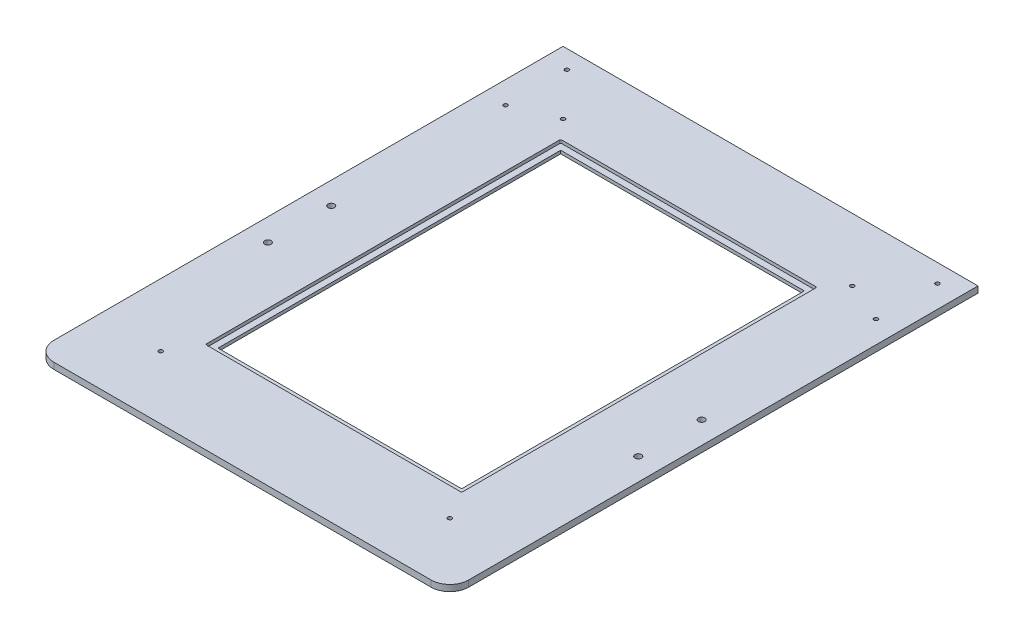
ISO-10303-21;
HEADER;
FILE_DESCRIPTION(('STEP AP214'),'2;1');
FILE_NAME('part.step','',(''),(''),'','','');
FILE_SCHEMA(('AUTOMOTIVE_DESIGN { 1 0 10303 214 1 1 1 1 }'));
ENDSEC;
DATA;
#1=APPLICATION_CONTEXT('core data for automotive mechanical design processes');
#2=APPLICATION_PROTOCOL_DEFINITION('international standard','automotive_design',2000,#1);
#3=PRODUCT_CONTEXT('',#1,'mechanical');
#4=PRODUCT('Part','Part','',(#3));
#5=PRODUCT_RELATED_PRODUCT_CATEGORY('part','',(#4));
#6=PRODUCT_DEFINITION_FORMATION('','',#4);
#7=PRODUCT_DEFINITION_CONTEXT('part definition',#1,'design');
#8=PRODUCT_DEFINITION('design','',#6,#7);
#9=PRODUCT_DEFINITION_SHAPE('','',#8);
#10=(LENGTH_UNIT() NAMED_UNIT(*) SI_UNIT(.MILLI.,.METRE.));
#11=(NAMED_UNIT(*) PLANE_ANGLE_UNIT() SI_UNIT($,.RADIAN.));
#12=(NAMED_UNIT(*) SI_UNIT($,.STERADIAN.) SOLID_ANGLE_UNIT());
#13=UNCERTAINTY_MEASURE_WITH_UNIT(LENGTH_MEASURE(1.E-05),#10,'distance_accuracy_value','');
#14=(GEOMETRIC_REPRESENTATION_CONTEXT(3) GLOBAL_UNCERTAINTY_ASSIGNED_CONTEXT((#13)) GLOBAL_UNIT_ASSIGNED_CONTEXT((#10,
#11,#12)) REPRESENTATION_CONTEXT('',''));
#15=CARTESIAN_POINT('',(0.,0.,0.));
#16=DIRECTION('',(0.,0.,1.));
#17=DIRECTION('',(1.,0.,0.));
#18=AXIS2_PLACEMENT_3D('',#15,#16,#17);
#19=CARTESIAN_POINT('',(0.,6.35,0.));
#20=DIRECTION('',(0.,-1.,0.));
#21=DIRECTION('',(0.,0.,-1.));
#22=AXIS2_PLACEMENT_3D('',#19,#20,#21);
#23=PLANE('',#22);
#24=CARTESIAN_POINT('',(22.4789999999999,6.35,-212.7504));
#25=DIRECTION('',(0.,1.,0.));
#26=DIRECTION('',(0.,0.,1.));
#27=AXIS2_PLACEMENT_3D('',#24,#25,#26);
#28=CIRCLE('',#27,3.26389999999999);
#29=CARTESIAN_POINT('',(22.4789999999999,6.35,-209.4865));
#30=VERTEX_POINT('',#29);
#31=EDGE_CURVE('E488',#30,#30,#28,.T.);
#32=ORIENTED_EDGE('',*,*,#31,.F.);
#33=EDGE_LOOP('',(#32));
#34=FACE_BOUND('',#33,.T.);
#35=CARTESIAN_POINT('',(396.621,6.35,-212.7504));
#36=DIRECTION('',(0.,1.,0.));
#37=DIRECTION('',(0.,0.,1.));
#38=AXIS2_PLACEMENT_3D('',#35,#36,#37);
#39=CIRCLE('',#38,3.26389999999999);
#40=CARTESIAN_POINT('',(396.621,6.35,-209.4865));
#41=VERTEX_POINT('',#40);
#42=EDGE_CURVE('E499',#41,#41,#39,.T.);
#43=ORIENTED_EDGE('',*,*,#42,.F.);
#44=EDGE_LOOP('',(#43));
#45=FACE_BOUND('',#44,.T.);
#46=CARTESIAN_POINT('',(22.4789999999999,6.35,-452.8185));
#47=DIRECTION('',(0.,1.,0.));
#48=DIRECTION('',(0.,0.,1.));
#49=AXIS2_PLACEMENT_3D('',#46,#47,#48);
#50=CIRCLE('',#49,2.01929999999999);
#51=CARTESIAN_POINT('',(22.4789999999999,6.35,-450.7992));
#52=VERTEX_POINT('',#51);
#53=EDGE_CURVE('E507',#52,#52,#50,.T.);
#54=ORIENTED_EDGE('',*,*,#53,.F.);
#55=EDGE_LOOP('',(#54));
#56=FACE_BOUND('',#55,.T.);
#57=CARTESIAN_POINT('',(396.621,6.35,-452.8185));
#58=DIRECTION('',(0.,1.,0.));
#59=DIRECTION('',(0.,0.,1.));
#60=AXIS2_PLACEMENT_3D('',#57,#58,#59);
#61=CIRCLE('',#60,2.0193);
#62=CARTESIAN_POINT('',(396.621,6.35,-450.7992));
#63=VERTEX_POINT('',#62);
#64=EDGE_CURVE('E515',#63,#63,#61,.T.);
#65=ORIENTED_EDGE('',*,*,#64,.F.);
#66=EDGE_LOOP('',(#65));
#67=FACE_BOUND('',#66,.T.);
#68=CARTESIAN_POINT('',(355.6,6.35,-469.9));
#69=DIRECTION('',(0.,1.,0.));
#70=DIRECTION('',(0.,0.,1.));
#71=AXIS2_PLACEMENT_3D('',#68,#69,#70);
#72=CIRCLE('',#71,2.0193);
#73=CARTESIAN_POINT('',(355.6,6.35,-467.8807));
#74=VERTEX_POINT('',#73);
#75=EDGE_CURVE('E523',#74,#74,#72,.T.);
#76=ORIENTED_EDGE('',*,*,#75,.F.);
#77=EDGE_LOOP('',(#76));
#78=FACE_BOUND('',#77,.T.);
#79=CARTESIAN_POINT('',(63.4999999999999,6.35,-63.5));
#80=DIRECTION('',(0.,1.,0.));
#81=DIRECTION('',(0.,0.,1.));
#82=AXIS2_PLACEMENT_3D('',#79,#80,#81);
#83=CIRCLE('',#82,2.01929999999999);
#84=CARTESIAN_POINT('',(63.4999999999999,6.35,-61.4807));
#85=VERTEX_POINT('',#84);
#86=EDGE_CURVE('E374',#85,#85,#83,.T.);
#87=ORIENTED_EDGE('',*,*,#86,.F.);
#88=EDGE_LOOP('',(#87));
#89=FACE_BOUND('',#88,.T.);
#90=DIRECTION('',(1.,0.,0.));
#91=VECTOR('',#90,1.);
#92=CARTESIAN_POINT('',(80.16875,6.35,-92.0750000000002));
#93=LINE('',#92,#91);
#94=CARTESIAN_POINT('',(81.43875,6.35,-92.0750000000002));
#95=VERTEX_POINT('',#94);
#96=CARTESIAN_POINT('',(337.66125,6.35,-92.0750000000002));
#97=VERTEX_POINT('',#96);
#98=EDGE_CURVE('E377',#95,#97,#93,.T.);
#99=ORIENTED_EDGE('',*,*,#98,.F.);
#100=CARTESIAN_POINT('',(81.43875,6.35,-93.3450000000002));
#101=DIRECTION('',(0.,-1.,0.));
#102=DIRECTION('',(0.,0.,-1.));
#103=AXIS2_PLACEMENT_3D('',#100,#101,#102);
#104=CIRCLE('',#103,1.27);
#105=CARTESIAN_POINT('',(80.16875,6.35,-93.3450000000001));
#106=VERTEX_POINT('',#105);
#107=EDGE_CURVE('E248',#95,#106,#104,.T.);
#108=ORIENTED_EDGE('',*,*,#107,.T.);
#109=DIRECTION('',(0.,0.,1.));
#110=VECTOR('',#109,1.);
#111=CARTESIAN_POINT('',(80.16875,6.35,-450.85));
#112=LINE('',#111,#110);
#113=CARTESIAN_POINT('',(80.16875,6.35,-449.58));
#114=VERTEX_POINT('',#113);
#115=EDGE_CURVE('E373',#114,#106,#112,.T.);
#116=ORIENTED_EDGE('',*,*,#115,.F.);
#117=CARTESIAN_POINT('',(81.4387499999999,6.35,-449.58));
#118=DIRECTION('',(0.,-1.,0.));
#119=DIRECTION('',(0.,0.,-1.));
#120=AXIS2_PLACEMENT_3D('',#117,#118,#119);
#121=CIRCLE('',#120,1.27);
#122=CARTESIAN_POINT('',(81.4387499999999,6.35,-450.85));
#123=VERTEX_POINT('',#122);
#124=EDGE_CURVE('E252',#114,#123,#121,.T.);
#125=ORIENTED_EDGE('',*,*,#124,.T.);
#126=DIRECTION('',(-1.,0.,0.));
#127=VECTOR('',#126,1.);
#128=CARTESIAN_POINT('',(338.93125,6.35,-450.85));
#129=LINE('',#128,#127);
#130=CARTESIAN_POINT('',(337.66125,6.35,-450.85));
#131=VERTEX_POINT('',#130);
#132=EDGE_CURVE('E387',#131,#123,#129,.T.);
#133=ORIENTED_EDGE('',*,*,#132,.F.);
#134=CARTESIAN_POINT('',(337.66125,6.35,-449.58));
#135=DIRECTION('',(0.,-1.,0.));
#136=DIRECTION('',(0.,0.,-1.));
#137=AXIS2_PLACEMENT_3D('',#134,#135,#136);
#138=CIRCLE('',#137,1.27);
#139=CARTESIAN_POINT('',(338.93125,6.35,-449.58));
#140=VERTEX_POINT('',#139);
#141=EDGE_CURVE('E250',#131,#140,#138,.T.);
#142=ORIENTED_EDGE('',*,*,#141,.T.);
#143=DIRECTION('',(0.,0.,-1.));
#144=VECTOR('',#143,1.);
#145=CARTESIAN_POINT('',(338.93125,6.35,-92.0750000000002));
#146=LINE('',#145,#144);
#147=CARTESIAN_POINT('',(338.93125,6.35,-93.3450000000002));
#148=VERTEX_POINT('',#147);
#149=EDGE_CURVE('E397',#148,#140,#146,.T.);
#150=ORIENTED_EDGE('',*,*,#149,.F.);
#151=CARTESIAN_POINT('',(337.66125,6.35,-93.3450000000002));
#152=DIRECTION('',(0.,-1.,0.));
#153=DIRECTION('',(0.,0.,-1.));
#154=AXIS2_PLACEMENT_3D('',#151,#152,#153);
#155=CIRCLE('',#154,1.27);
#156=EDGE_CURVE('E246',#148,#97,#155,.T.);
#157=ORIENTED_EDGE('',*,*,#156,.T.);
#158=EDGE_LOOP('',(#99,#108,#116,#125,#133,#142,#150,#157));
#159=FACE_BOUND('',#158,.T.);
#160=DIRECTION('',(1.,0.,0.));
#161=VECTOR('',#160,1.);
#162=CARTESIAN_POINT('',(0.,6.35,0.));
#163=LINE('',#162,#161);
#164=CARTESIAN_POINT('',(19.05,6.35,0.));
#165=VERTEX_POINT('',#164);
#166=CARTESIAN_POINT('',(400.05,6.35,0.));
#167=VERTEX_POINT('',#166);
#168=EDGE_CURVE('E201',#165,#167,#163,.T.);
#169=ORIENTED_EDGE('',*,*,#168,.T.);
#170=CARTESIAN_POINT('',(400.05,6.35,-19.0500000000001));
#171=DIRECTION('',(0.,-1.,0.));
#172=DIRECTION('',(0.,0.,-1.));
#173=AXIS2_PLACEMENT_3D('',#170,#171,#172);
#174=CIRCLE('',#173,19.05);
#175=CARTESIAN_POINT('',(419.1,6.35,-19.0500000000001));
#176=VERTEX_POINT('',#175);
#177=EDGE_CURVE('E44',#167,#176,#174,.F.);
#178=ORIENTED_EDGE('',*,*,#177,.T.);
#179=DIRECTION('',(0.,0.,-1.));
#180=VECTOR('',#179,1.);
#181=CARTESIAN_POINT('',(419.1,6.35,0.));
#182=LINE('',#181,#180);
#183=CARTESIAN_POINT('',(419.1,6.35,-533.4));
#184=VERTEX_POINT('',#183);
#185=EDGE_CURVE('E204',#176,#184,#182,.T.);
#186=ORIENTED_EDGE('',*,*,#185,.T.);
#187=DIRECTION('',(-1.,0.,0.));
#188=VECTOR('',#187,1.);
#189=CARTESIAN_POINT('',(-1.11022302462516E-13,6.35,-533.4));
#190=LINE('',#189,#188);
#191=CARTESIAN_POINT('',(-1.11022302462516E-13,6.35,-533.4));
#192=VERTEX_POINT('',#191);
#193=EDGE_CURVE('E206',#184,#192,#190,.T.);
#194=ORIENTED_EDGE('',*,*,#193,.T.);
#195=DIRECTION('',(0.,0.,1.));
#196=VECTOR('',#195,1.);
#197=CARTESIAN_POINT('',(0.,6.35,0.));
#198=LINE('',#197,#196);
#199=CARTESIAN_POINT('',(0.,6.35,-19.05));
#200=VERTEX_POINT('',#199);
#201=EDGE_CURVE('E199',#192,#200,#198,.T.);
#202=ORIENTED_EDGE('',*,*,#201,.T.);
#203=CARTESIAN_POINT('',(19.05,6.35,-19.05));
#204=DIRECTION('',(0.,-1.,0.));
#205=DIRECTION('',(0.,0.,-1.));
#206=AXIS2_PLACEMENT_3D('',#203,#204,#205);
#207=CIRCLE('',#206,19.05);
#208=EDGE_CURVE('E265',#200,#165,#207,.F.);
#209=ORIENTED_EDGE('',*,*,#208,.T.);
#210=EDGE_LOOP('',(#169,#178,#186,#194,#202,#209));
#211=FACE_BOUND('',#210,.T.);
#212=CARTESIAN_POINT('',(355.6,6.35,-63.5));
#213=DIRECTION('',(0.,1.,0.));
#214=DIRECTION('',(0.,0.,1.));
#215=AXIS2_PLACEMENT_3D('',#212,#213,#214);
#216=CIRCLE('',#215,2.0193);
#217=CARTESIAN_POINT('',(355.6,6.35,-61.4807));
#218=VERTEX_POINT('',#217);
#219=EDGE_CURVE('E527',#218,#218,#216,.T.);
#220=ORIENTED_EDGE('',*,*,#219,.F.);
#221=EDGE_LOOP('',(#220));
#222=FACE_BOUND('',#221,.T.);
#223=CARTESIAN_POINT('',(63.4999999999999,6.35,-469.9));
#224=DIRECTION('',(0.,1.,0.));
#225=DIRECTION('',(0.,0.,1.));
#226=AXIS2_PLACEMENT_3D('',#223,#224,#225);
#227=CIRCLE('',#226,2.01929999999999);
#228=CARTESIAN_POINT('',(63.4999999999999,6.35,-467.8807));
#229=VERTEX_POINT('',#228);
#230=EDGE_CURVE('E519',#229,#229,#227,.T.);
#231=ORIENTED_EDGE('',*,*,#230,.F.);
#232=EDGE_LOOP('',(#231));
#233=FACE_BOUND('',#232,.T.);
#234=CARTESIAN_POINT('',(396.621,6.35,-514.8707));
#235=DIRECTION('',(0.,1.,0.));
#236=DIRECTION('',(0.,0.,1.));
#237=AXIS2_PLACEMENT_3D('',#234,#235,#236);
#238=CIRCLE('',#237,2.0193);
#239=CARTESIAN_POINT('',(396.621,6.35,-512.8514));
#240=VERTEX_POINT('',#239);
#241=EDGE_CURVE('E511',#240,#240,#238,.T.);
#242=ORIENTED_EDGE('',*,*,#241,.F.);
#243=EDGE_LOOP('',(#242));
#244=FACE_BOUND('',#243,.T.);
#245=CARTESIAN_POINT('',(22.4789999999999,6.35,-514.8707));
#246=DIRECTION('',(0.,1.,0.));
#247=DIRECTION('',(0.,0.,1.));
#248=AXIS2_PLACEMENT_3D('',#245,#246,#247);
#249=CIRCLE('',#248,2.01929999999999);
#250=CARTESIAN_POINT('',(22.4789999999999,6.35,-512.8514));
#251=VERTEX_POINT('',#250);
#252=EDGE_CURVE('E503',#251,#251,#249,.T.);
#253=ORIENTED_EDGE('',*,*,#252,.F.);
#254=EDGE_LOOP('',(#253));
#255=FACE_BOUND('',#254,.T.);
#256=CARTESIAN_POINT('',(396.621,6.35,-276.7965));
#257=DIRECTION('',(0.,1.,0.));
#258=DIRECTION('',(0.,0.,1.));
#259=AXIS2_PLACEMENT_3D('',#256,#257,#258);
#260=CIRCLE('',#259,3.26389999999999);
#261=CARTESIAN_POINT('',(396.621,6.35,-273.5326));
#262=VERTEX_POINT('',#261);
#263=EDGE_CURVE('E495',#262,#262,#260,.T.);
#264=ORIENTED_EDGE('',*,*,#263,.F.);
#265=EDGE_LOOP('',(#264));
#266=FACE_BOUND('',#265,.T.);
#267=CARTESIAN_POINT('',(22.4789999999999,6.35,-276.7965));
#268=DIRECTION('',(0.,1.,0.));
#269=DIRECTION('',(0.,0.,1.));
#270=AXIS2_PLACEMENT_3D('',#267,#268,#269);
#271=CIRCLE('',#270,3.26389999999999);
#272=CARTESIAN_POINT('',(22.4789999999999,6.35,-273.5326));
#273=VERTEX_POINT('',#272);
#274=EDGE_CURVE('E487',#273,#273,#271,.T.);
#275=ORIENTED_EDGE('',*,*,#274,.F.);
#276=EDGE_LOOP('',(#275));
#277=FACE_BOUND('',#276,.T.);
#278=ADVANCED_FACE('F36',(#34,#45,#56,#67,#78,#89,#159,#211,#222,#233,#244,#255,#266,#277),#23,.F.);
#279=CARTESIAN_POINT('',(86.51875,6.35,-444.5));
#280=DIRECTION('',(1.,0.,0.));
#281=DIRECTION('',(0.,0.,-1.));
#282=AXIS2_PLACEMENT_3D('',#279,#280,#281);
#283=PLANE('',#282);
#284=DIRECTION('',(0.,-1.,0.));
#285=VECTOR('',#284,1.);
#286=CARTESIAN_POINT('',(86.51875,6.35,-444.5));
#287=LINE('',#286,#285);
#288=CARTESIAN_POINT('',(86.51875,3.15000005,-444.5));
#289=VERTEX_POINT('',#288);
#290=CARTESIAN_POINT('',(86.51875,0.,-444.5));
#291=VERTEX_POINT('',#290);
#292=EDGE_CURVE('E190',#289,#291,#287,.T.);
#293=ORIENTED_EDGE('',*,*,#292,.F.);
#294=DIRECTION('',(0.,0.,1.));
#295=VECTOR('',#294,1.);
#296=CARTESIAN_POINT('',(86.51875,3.15000005,-444.5));
#297=LINE('',#296,#295);
#298=CARTESIAN_POINT('',(86.51875,3.15000005,-98.4250000000002));
#299=VERTEX_POINT('',#298);
#300=EDGE_CURVE('E169',#289,#299,#297,.T.);
#301=ORIENTED_EDGE('',*,*,#300,.T.);
#302=DIRECTION('',(0.,-1.,0.));
#303=VECTOR('',#302,1.);
#304=CARTESIAN_POINT('',(86.51875,6.35,-98.4250000000002));
#305=LINE('',#304,#303);
#306=CARTESIAN_POINT('',(86.51875,0.,-98.4250000000002));
#307=VERTEX_POINT('',#306);
#308=EDGE_CURVE('E192',#299,#307,#305,.T.);
#309=ORIENTED_EDGE('',*,*,#308,.T.);
#310=DIRECTION('',(0.,0.,1.));
#311=VECTOR('',#310,1.);
#312=CARTESIAN_POINT('',(86.51875,0.,-444.5));
#313=LINE('',#312,#311);
#314=EDGE_CURVE('E404',#291,#307,#313,.T.);
#315=ORIENTED_EDGE('',*,*,#314,.F.);
#316=EDGE_LOOP('',(#293,#301,#309,#315));
#317=FACE_BOUND('',#316,.T.);
#318=ADVANCED_FACE('F305',(#317),#283,.T.);
#319=CARTESIAN_POINT('',(86.51875,6.35,-98.4250000000002));
#320=DIRECTION('',(0.,0.,-1.));
#321=DIRECTION('',(-1.,0.,0.));
#322=AXIS2_PLACEMENT_3D('',#319,#320,#321);
#323=PLANE('',#322);
#324=ORIENTED_EDGE('',*,*,#308,.F.);
#325=DIRECTION('',(1.,0.,0.));
#326=VECTOR('',#325,1.);
#327=CARTESIAN_POINT('',(86.51875,3.15000005,-98.4250000000002));
#328=LINE('',#327,#326);
#329=CARTESIAN_POINT('',(332.58125,3.15000005,-98.4250000000002));
#330=VERTEX_POINT('',#329);
#331=EDGE_CURVE('E183',#299,#330,#328,.T.);
#332=ORIENTED_EDGE('',*,*,#331,.T.);
#333=DIRECTION('',(0.,-1.,0.));
#334=VECTOR('',#333,1.);
#335=CARTESIAN_POINT('',(332.58125,6.35,-98.4250000000002));
#336=LINE('',#335,#334);
#337=CARTESIAN_POINT('',(332.58125,0.,-98.4250000000002));
#338=VERTEX_POINT('',#337);
#339=EDGE_CURVE('E182',#330,#338,#336,.T.);
#340=ORIENTED_EDGE('',*,*,#339,.T.);
#341=DIRECTION('',(1.,0.,0.));
#342=VECTOR('',#341,1.);
#343=CARTESIAN_POINT('',(86.51875,0.,-98.4250000000002));
#344=LINE('',#343,#342);
#345=EDGE_CURVE('E407',#307,#338,#344,.T.);
#346=ORIENTED_EDGE('',*,*,#345,.F.);
#347=EDGE_LOOP('',(#324,#332,#340,#346));
#348=FACE_BOUND('',#347,.T.);
#349=ADVANCED_FACE('F311',(#348),#323,.T.);
#350=CARTESIAN_POINT('',(332.58125,6.35,-444.5));
#351=DIRECTION('',(-1.,0.,0.));
#352=DIRECTION('',(0.,0.,1.));
#353=AXIS2_PLACEMENT_3D('',#350,#351,#352);
#354=PLANE('',#353);
#355=ORIENTED_EDGE('',*,*,#339,.F.);
#356=DIRECTION('',(0.,0.,-1.));
#357=VECTOR('',#356,1.);
#358=CARTESIAN_POINT('',(332.58125,3.15000005,-444.5));
#359=LINE('',#358,#357);
#360=CARTESIAN_POINT('',(332.58125,3.15000005,-444.5));
#361=VERTEX_POINT('',#360);
#362=EDGE_CURVE('E166',#330,#361,#359,.T.);
#363=ORIENTED_EDGE('',*,*,#362,.T.);
#364=DIRECTION('',(0.,-1.,0.));
#365=VECTOR('',#364,1.);
#366=CARTESIAN_POINT('',(332.58125,6.35,-444.5));
#367=LINE('',#366,#365);
#368=CARTESIAN_POINT('',(332.58125,0.,-444.5));
#369=VERTEX_POINT('',#368);
#370=EDGE_CURVE('E180',#361,#369,#367,.T.);
#371=ORIENTED_EDGE('',*,*,#370,.T.);
#372=DIRECTION('',(0.,0.,-1.));
#373=VECTOR('',#372,1.);
#374=CARTESIAN_POINT('',(332.58125,0.,-444.5));
#375=LINE('',#374,#373);
#376=EDGE_CURVE('E410',#338,#369,#375,.T.);
#377=ORIENTED_EDGE('',*,*,#376,.F.);
#378=EDGE_LOOP('',(#355,#363,#371,#377));
#379=FACE_BOUND('',#378,.T.);
#380=ADVANCED_FACE('F178',(#379),#354,.T.);
#381=CARTESIAN_POINT('',(86.51875,6.35,-444.5));
#382=DIRECTION('',(0.,0.,1.));
#383=DIRECTION('',(1.,0.,0.));
#384=AXIS2_PLACEMENT_3D('',#381,#382,#383);
#385=PLANE('',#384);
#386=ORIENTED_EDGE('',*,*,#370,.F.);
#387=DIRECTION('',(-1.,0.,0.));
#388=VECTOR('',#387,1.);
#389=CARTESIAN_POINT('',(86.51875,3.15000005,-444.5));
#390=LINE('',#389,#388);
#391=EDGE_CURVE('E162',#361,#289,#390,.T.);
#392=ORIENTED_EDGE('',*,*,#391,.T.);
#393=ORIENTED_EDGE('',*,*,#292,.T.);
#394=DIRECTION('',(-1.,0.,0.));
#395=VECTOR('',#394,1.);
#396=CARTESIAN_POINT('',(86.51875,0.,-444.5));
#397=LINE('',#396,#395);
#398=EDGE_CURVE('E188',#369,#291,#397,.T.);
#399=ORIENTED_EDGE('',*,*,#398,.F.);
#400=EDGE_LOOP('',(#386,#392,#393,#399));
#401=FACE_BOUND('',#400,.T.);
#402=ADVANCED_FACE('F186',(#401),#385,.T.);
#403=CARTESIAN_POINT('',(0.,0.,0.));
#404=DIRECTION('',(0.,-1.,0.));
#405=DIRECTION('',(0.,0.,-1.));
#406=AXIS2_PLACEMENT_3D('',#403,#404,#405);
#407=PLANE('',#406);
#408=CARTESIAN_POINT('',(22.4789999999999,0.,-276.7965));
#409=DIRECTION('',(0.,-1.,0.));
#410=DIRECTION('',(0.,0.,-1.));
#411=AXIS2_PLACEMENT_3D('',#408,#409,#410);
#412=CIRCLE('',#411,3.26389999999999);
#413=CARTESIAN_POINT('',(22.4789999999999,0.,-280.0604));
#414=VERTEX_POINT('',#413);
#415=EDGE_CURVE('E328',#414,#414,#412,.T.);
#416=ORIENTED_EDGE('',*,*,#415,.F.);
#417=EDGE_LOOP('',(#416));
#418=FACE_BOUND('',#417,.T.);
#419=CARTESIAN_POINT('',(22.4789999999999,0.,-212.7504));
#420=DIRECTION('',(0.,-1.,0.));
#421=DIRECTION('',(0.,0.,-1.));
#422=AXIS2_PLACEMENT_3D('',#419,#420,#421);
#423=CIRCLE('',#422,3.26389999999999);
#424=CARTESIAN_POINT('',(22.4789999999999,0.,-216.0143));
#425=VERTEX_POINT('',#424);
#426=EDGE_CURVE('E332',#425,#425,#423,.T.);
#427=ORIENTED_EDGE('',*,*,#426,.F.);
#428=EDGE_LOOP('',(#427));
#429=FACE_BOUND('',#428,.T.);
#430=CARTESIAN_POINT('',(396.621,0.,-276.7965));
#431=DIRECTION('',(0.,-1.,0.));
#432=DIRECTION('',(0.,0.,-1.));
#433=AXIS2_PLACEMENT_3D('',#430,#431,#432);
#434=CIRCLE('',#433,3.26389999999999);
#435=CARTESIAN_POINT('',(396.621,0.,-280.0604));
#436=VERTEX_POINT('',#435);
#437=EDGE_CURVE('E336',#436,#436,#434,.T.);
#438=ORIENTED_EDGE('',*,*,#437,.F.);
#439=EDGE_LOOP('',(#438));
#440=FACE_BOUND('',#439,.T.);
#441=CARTESIAN_POINT('',(396.621,0.,-212.7504));
#442=DIRECTION('',(0.,-1.,0.));
#443=DIRECTION('',(0.,0.,-1.));
#444=AXIS2_PLACEMENT_3D('',#441,#442,#443);
#445=CIRCLE('',#444,3.26389999999999);
#446=CARTESIAN_POINT('',(396.621,0.,-216.0143));
#447=VERTEX_POINT('',#446);
#448=EDGE_CURVE('E340',#447,#447,#445,.T.);
#449=ORIENTED_EDGE('',*,*,#448,.F.);
#450=EDGE_LOOP('',(#449));
#451=FACE_BOUND('',#450,.T.);
#452=CARTESIAN_POINT('',(22.4789999999999,0.,-514.8707));
#453=DIRECTION('',(0.,-1.,0.));
#454=DIRECTION('',(0.,0.,-1.));
#455=AXIS2_PLACEMENT_3D('',#452,#453,#454);
#456=CIRCLE('',#455,2.01929999999999);
#457=CARTESIAN_POINT('',(22.4789999999999,0.,-516.89));
#458=VERTEX_POINT('',#457);
#459=EDGE_CURVE('E344',#458,#458,#456,.T.);
#460=ORIENTED_EDGE('',*,*,#459,.F.);
#461=EDGE_LOOP('',(#460));
#462=FACE_BOUND('',#461,.T.);
#463=CARTESIAN_POINT('',(22.4789999999999,0.,-452.8185));
#464=DIRECTION('',(0.,-1.,0.));
#465=DIRECTION('',(0.,0.,-1.));
#466=AXIS2_PLACEMENT_3D('',#463,#464,#465);
#467=CIRCLE('',#466,2.01929999999999);
#468=CARTESIAN_POINT('',(22.4789999999999,0.,-454.8378));
#469=VERTEX_POINT('',#468);
#470=EDGE_CURVE('E348',#469,#469,#467,.T.);
#471=ORIENTED_EDGE('',*,*,#470,.F.);
#472=EDGE_LOOP('',(#471));
#473=FACE_BOUND('',#472,.T.);
#474=CARTESIAN_POINT('',(396.621,0.,-514.8707));
#475=DIRECTION('',(0.,-1.,0.));
#476=DIRECTION('',(0.,0.,-1.));
#477=AXIS2_PLACEMENT_3D('',#474,#475,#476);
#478=CIRCLE('',#477,2.0193);
#479=CARTESIAN_POINT('',(396.621,0.,-516.89));
#480=VERTEX_POINT('',#479);
#481=EDGE_CURVE('E352',#480,#480,#478,.T.);
#482=ORIENTED_EDGE('',*,*,#481,.F.);
#483=EDGE_LOOP('',(#482));
#484=FACE_BOUND('',#483,.T.);
#485=CARTESIAN_POINT('',(396.621,0.,-452.8185));
#486=DIRECTION('',(0.,-1.,0.));
#487=DIRECTION('',(0.,0.,-1.));
#488=AXIS2_PLACEMENT_3D('',#485,#486,#487);
#489=CIRCLE('',#488,2.0193);
#490=CARTESIAN_POINT('',(396.621,0.,-454.8378));
#491=VERTEX_POINT('',#490);
#492=EDGE_CURVE('E356',#491,#491,#489,.T.);
#493=ORIENTED_EDGE('',*,*,#492,.F.);
#494=EDGE_LOOP('',(#493));
#495=FACE_BOUND('',#494,.T.);
#496=CARTESIAN_POINT('',(63.4999999999999,0.,-469.9));
#497=DIRECTION('',(0.,-1.,0.));
#498=DIRECTION('',(0.,0.,-1.));
#499=AXIS2_PLACEMENT_3D('',#496,#497,#498);
#500=CIRCLE('',#499,2.01929999999999);
#501=CARTESIAN_POINT('',(63.4999999999999,0.,-471.9193));
#502=VERTEX_POINT('',#501);
#503=EDGE_CURVE('E360',#502,#502,#500,.T.);
#504=ORIENTED_EDGE('',*,*,#503,.F.);
#505=EDGE_LOOP('',(#504));
#506=FACE_BOUND('',#505,.T.);
#507=CARTESIAN_POINT('',(355.6,0.,-469.9));
#508=DIRECTION('',(0.,-1.,0.));
#509=DIRECTION('',(0.,0.,-1.));
#510=AXIS2_PLACEMENT_3D('',#507,#508,#509);
#511=CIRCLE('',#510,2.0193);
#512=CARTESIAN_POINT('',(355.6,0.,-471.9193));
#513=VERTEX_POINT('',#512);
#514=EDGE_CURVE('E364',#513,#513,#511,.T.);
#515=ORIENTED_EDGE('',*,*,#514,.F.);
#516=EDGE_LOOP('',(#515));
#517=FACE_BOUND('',#516,.T.);
#518=CARTESIAN_POINT('',(355.6,0.,-63.5));
#519=DIRECTION('',(0.,-1.,0.));
#520=DIRECTION('',(0.,0.,-1.));
#521=AXIS2_PLACEMENT_3D('',#518,#519,#520);
#522=CIRCLE('',#521,2.0193);
#523=CARTESIAN_POINT('',(355.6,0.,-65.5193));
#524=VERTEX_POINT('',#523);
#525=EDGE_CURVE('E368',#524,#524,#522,.T.);
#526=ORIENTED_EDGE('',*,*,#525,.F.);
#527=EDGE_LOOP('',(#526));
#528=FACE_BOUND('',#527,.T.);
#529=CARTESIAN_POINT('',(63.4999999999999,0.,-63.5));
#530=DIRECTION('',(0.,-1.,0.));
#531=DIRECTION('',(0.,0.,-1.));
#532=AXIS2_PLACEMENT_3D('',#529,#530,#531);
#533=CIRCLE('',#532,2.01929999999999);
#534=CARTESIAN_POINT('',(63.4999999999999,0.,-65.5193));
#535=VERTEX_POINT('',#534);
#536=EDGE_CURVE('E371',#535,#535,#533,.T.);
#537=ORIENTED_EDGE('',*,*,#536,.F.);
#538=EDGE_LOOP('',(#537));
#539=FACE_BOUND('',#538,.T.);
#540=DIRECTION('',(0.,0.,-1.));
#541=VECTOR('',#540,1.);
#542=CARTESIAN_POINT('',(419.1,0.,0.));
#543=LINE('',#542,#541);
#544=CARTESIAN_POINT('',(419.1,0.,-19.0500000000001));
#545=VERTEX_POINT('',#544);
#546=CARTESIAN_POINT('',(419.1,0.,-533.4));
#547=VERTEX_POINT('',#546);
#548=EDGE_CURVE('E212',#545,#547,#543,.T.);
#549=ORIENTED_EDGE('',*,*,#548,.F.);
#550=CARTESIAN_POINT('',(400.05,0.,-19.0500000000001));
#551=DIRECTION('',(0.,-1.,0.));
#552=DIRECTION('',(0.,0.,-1.));
#553=AXIS2_PLACEMENT_3D('',#550,#551,#552);
#554=CIRCLE('',#553,19.05);
#555=CARTESIAN_POINT('',(400.05,0.,0.));
#556=VERTEX_POINT('',#555);
#557=EDGE_CURVE('E259',#545,#556,#554,.T.);
#558=ORIENTED_EDGE('',*,*,#557,.T.);
#559=DIRECTION('',(1.,0.,0.));
#560=VECTOR('',#559,1.);
#561=CARTESIAN_POINT('',(0.,0.,0.));
#562=LINE('',#561,#560);
#563=CARTESIAN_POINT('',(19.05,0.,0.));
#564=VERTEX_POINT('',#563);
#565=EDGE_CURVE('E210',#564,#556,#562,.T.);
#566=ORIENTED_EDGE('',*,*,#565,.F.);
#567=CARTESIAN_POINT('',(19.05,0.,-19.05));
#568=DIRECTION('',(0.,-1.,0.));
#569=DIRECTION('',(0.,0.,-1.));
#570=AXIS2_PLACEMENT_3D('',#567,#568,#569);
#571=CIRCLE('',#570,19.05);
#572=CARTESIAN_POINT('',(0.,0.,-19.05));
#573=VERTEX_POINT('',#572);
#574=EDGE_CURVE('E257',#564,#573,#571,.T.);
#575=ORIENTED_EDGE('',*,*,#574,.T.);
#576=DIRECTION('',(0.,0.,1.));
#577=VECTOR('',#576,1.);
#578=CARTESIAN_POINT('',(0.,0.,0.));
#579=LINE('',#578,#577);
#580=CARTESIAN_POINT('',(-1.11022302462516E-13,0.,-533.4));
#581=VERTEX_POINT('',#580);
#582=EDGE_CURVE('E198',#581,#573,#579,.T.);
#583=ORIENTED_EDGE('',*,*,#582,.F.);
#584=DIRECTION('',(-1.,0.,0.));
#585=VECTOR('',#584,1.);
#586=CARTESIAN_POINT('',(-1.11022302462516E-13,0.,-533.4));
#587=LINE('',#586,#585);
#588=EDGE_CURVE('E202',#547,#581,#587,.T.);
#589=ORIENTED_EDGE('',*,*,#588,.F.);
#590=EDGE_LOOP('',(#549,#558,#566,#575,#583,#589));
#591=FACE_BOUND('',#590,.T.);
#592=ORIENTED_EDGE('',*,*,#398,.T.);
#593=ORIENTED_EDGE('',*,*,#314,.T.);
#594=ORIENTED_EDGE('',*,*,#345,.T.);
#595=ORIENTED_EDGE('',*,*,#376,.T.);
#596=EDGE_LOOP('',(#592,#593,#594,#595));
#597=FACE_BOUND('',#596,.T.);
#598=ADVANCED_FACE('F280',(#418,#429,#440,#451,#462,#473,#484,#495,#506,#517,#528,#539,#591,
#597),#407,.T.);
#599=CARTESIAN_POINT('',(0.,6.35,0.));
#600=DIRECTION('',(1.,0.,0.));
#601=DIRECTION('',(0.,0.,-1.));
#602=AXIS2_PLACEMENT_3D('',#599,#600,#601);
#603=PLANE('',#602);
#604=ORIENTED_EDGE('',*,*,#582,.T.);
#605=DIRECTION('',(0.,-1.,0.));
#606=VECTOR('',#605,1.);
#607=CARTESIAN_POINT('',(0.,6.35,-19.05));
#608=LINE('',#607,#606);
#609=EDGE_CURVE('E11',#573,#200,#608,.F.);
#610=ORIENTED_EDGE('',*,*,#609,.T.);
#611=ORIENTED_EDGE('',*,*,#201,.F.);
#612=DIRECTION('',(0.,-1.,0.));
#613=VECTOR('',#612,1.);
#614=CARTESIAN_POINT('',(-1.11022302462516E-13,6.35,-533.4));
#615=LINE('',#614,#613);
#616=EDGE_CURVE('E208',#192,#581,#615,.T.);
#617=ORIENTED_EDGE('',*,*,#616,.T.);
#618=EDGE_LOOP('',(#604,#610,#611,#617));
#619=FACE_BOUND('',#618,.T.);
#620=ADVANCED_FACE('F288',(#619),#603,.F.);
#621=CARTESIAN_POINT('',(0.,6.35,0.));
#622=DIRECTION('',(0.,0.,-1.));
#623=DIRECTION('',(-1.,0.,0.));
#624=AXIS2_PLACEMENT_3D('',#621,#622,#623);
#625=PLANE('',#624);
#626=ORIENTED_EDGE('',*,*,#565,.T.);
#627=DIRECTION('',(0.,-1.,0.));
#628=VECTOR('',#627,1.);
#629=CARTESIAN_POINT('',(400.05,6.35,0.));
#630=LINE('',#629,#628);
#631=EDGE_CURVE('E57',#556,#167,#630,.F.);
#632=ORIENTED_EDGE('',*,*,#631,.T.);
#633=ORIENTED_EDGE('',*,*,#168,.F.);
#634=DIRECTION('',(0.,-1.,0.));
#635=VECTOR('',#634,1.);
#636=CARTESIAN_POINT('',(19.05,6.35,0.));
#637=LINE('',#636,#635);
#638=EDGE_CURVE('E261',#165,#564,#637,.T.);
#639=ORIENTED_EDGE('',*,*,#638,.T.);
#640=EDGE_LOOP('',(#626,#632,#633,#639));
#641=FACE_BOUND('',#640,.T.);
#642=ADVANCED_FACE('F283',(#641),#625,.F.);
#643=CARTESIAN_POINT('',(419.1,6.35,0.));
#644=DIRECTION('',(-1.,0.,0.));
#645=DIRECTION('',(0.,0.,1.));
#646=AXIS2_PLACEMENT_3D('',#643,#644,#645);
#647=PLANE('',#646);
#648=ORIENTED_EDGE('',*,*,#185,.F.);
#649=DIRECTION('',(0.,-1.,0.));
#650=VECTOR('',#649,1.);
#651=CARTESIAN_POINT('',(419.1,6.35,-19.0500000000001));
#652=LINE('',#651,#650);
#653=EDGE_CURVE('E254',#176,#545,#652,.T.);
#654=ORIENTED_EDGE('',*,*,#653,.T.);
#655=ORIENTED_EDGE('',*,*,#548,.T.);
#656=DIRECTION('',(0.,-1.,0.));
#657=VECTOR('',#656,1.);
#658=CARTESIAN_POINT('',(419.1,6.35,-533.4));
#659=LINE('',#658,#657);
#660=EDGE_CURVE('E174',#184,#547,#659,.T.);
#661=ORIENTED_EDGE('',*,*,#660,.F.);
#662=EDGE_LOOP('',(#648,#654,#655,#661));
#663=FACE_BOUND('',#662,.T.);
#664=ADVANCED_FACE('F274',(#663),#647,.F.);
#665=CARTESIAN_POINT('',(-1.11022302462516E-13,6.35,-533.4));
#666=DIRECTION('',(0.,0.,1.));
#667=DIRECTION('',(1.,0.,0.));
#668=AXIS2_PLACEMENT_3D('',#665,#666,#667);
#669=PLANE('',#668);
#670=ORIENTED_EDGE('',*,*,#588,.T.);
#671=ORIENTED_EDGE('',*,*,#616,.F.);
#672=ORIENTED_EDGE('',*,*,#193,.F.);
#673=ORIENTED_EDGE('',*,*,#660,.T.);
#674=EDGE_LOOP('',(#670,#671,#672,#673));
#675=FACE_BOUND('',#674,.T.);
#676=ADVANCED_FACE('F291',(#675),#669,.F.);
#677=CARTESIAN_POINT('',(80.16875,3.15000005,-450.85));
#678=DIRECTION('',(-1.,0.,0.));
#679=DIRECTION('',(0.,0.,1.));
#680=AXIS2_PLACEMENT_3D('',#677,#678,#679);
#681=PLANE('',#680);
#682=ORIENTED_EDGE('',*,*,#115,.T.);
#683=DIRECTION('',(0.,1.,0.));
#684=VECTOR('',#683,1.);
#685=CARTESIAN_POINT('',(80.16875,3.15000005,-93.3450000000002));
#686=LINE('',#685,#684);
#687=CARTESIAN_POINT('',(80.16875,3.15000005,-93.3450000000001));
#688=VERTEX_POINT('',#687);
#689=EDGE_CURVE('E239',#106,#688,#686,.F.);
#690=ORIENTED_EDGE('',*,*,#689,.T.);
#691=DIRECTION('',(0.,0.,1.));
#692=VECTOR('',#691,1.);
#693=CARTESIAN_POINT('',(80.16875,3.15000005,-450.85));
#694=LINE('',#693,#692);
#695=CARTESIAN_POINT('',(80.16875,3.15000005,-449.58));
#696=VERTEX_POINT('',#695);
#697=EDGE_CURVE('E383',#696,#688,#694,.T.);
#698=ORIENTED_EDGE('',*,*,#697,.F.);
#699=DIRECTION('',(0.,1.,0.));
#700=VECTOR('',#699,1.);
#701=CARTESIAN_POINT('',(80.16875,6.35,-449.58));
#702=LINE('',#701,#700);
#703=EDGE_CURVE('E236',#696,#114,#702,.T.);
#704=ORIENTED_EDGE('',*,*,#703,.T.);
#705=EDGE_LOOP('',(#682,#690,#698,#704));
#706=FACE_BOUND('',#705,.T.);
#707=ADVANCED_FACE('F293',(#706),#681,.F.);
#708=CARTESIAN_POINT('',(338.93125,3.15000005,-450.85));
#709=DIRECTION('',(0.,0.,-1.));
#710=DIRECTION('',(-1.,0.,0.));
#711=AXIS2_PLACEMENT_3D('',#708,#709,#710);
#712=PLANE('',#711);
#713=DIRECTION('',(-1.,0.,0.));
#714=VECTOR('',#713,1.);
#715=CARTESIAN_POINT('',(338.93125,3.15000005,-450.85));
#716=LINE('',#715,#714);
#717=CARTESIAN_POINT('',(337.66125,3.15000005,-450.85));
#718=VERTEX_POINT('',#717);
#719=CARTESIAN_POINT('',(81.4387499999999,3.15000005,-450.85));
#720=VERTEX_POINT('',#719);
#721=EDGE_CURVE('E184',#718,#720,#716,.T.);
#722=ORIENTED_EDGE('',*,*,#721,.F.);
#723=DIRECTION('',(0.,1.,0.));
#724=VECTOR('',#723,1.);
#725=CARTESIAN_POINT('',(337.66125,6.35,-450.85));
#726=LINE('',#725,#724);
#727=EDGE_CURVE('E243',#718,#131,#726,.T.);
#728=ORIENTED_EDGE('',*,*,#727,.T.);
#729=ORIENTED_EDGE('',*,*,#132,.T.);
#730=DIRECTION('',(0.,1.,0.));
#731=VECTOR('',#730,1.);
#732=CARTESIAN_POINT('',(81.4387499999999,3.15000005,-450.85));
#733=LINE('',#732,#731);
#734=EDGE_CURVE('E241',#123,#720,#733,.F.);
#735=ORIENTED_EDGE('',*,*,#734,.T.);
#736=EDGE_LOOP('',(#722,#728,#729,#735));
#737=FACE_BOUND('',#736,.T.);
#738=ADVANCED_FACE('F299',(#737),#712,.F.);
#739=CARTESIAN_POINT('',(338.93125,3.15000005,-92.0750000000002));
#740=DIRECTION('',(1.,0.,0.));
#741=DIRECTION('',(0.,0.,-1.));
#742=AXIS2_PLACEMENT_3D('',#739,#740,#741);
#743=PLANE('',#742);
#744=DIRECTION('',(0.,0.,-1.));
#745=VECTOR('',#744,1.);
#746=CARTESIAN_POINT('',(338.93125,3.15000005,-92.0750000000002));
#747=LINE('',#746,#745);
#748=CARTESIAN_POINT('',(338.93125,3.15000005,-93.3450000000002));
#749=VERTEX_POINT('',#748);
#750=CARTESIAN_POINT('',(338.93125,3.15000005,-449.58));
#751=VERTEX_POINT('',#750);
#752=EDGE_CURVE('E390',#749,#751,#747,.T.);
#753=ORIENTED_EDGE('',*,*,#752,.F.);
#754=DIRECTION('',(0.,1.,0.));
#755=VECTOR('',#754,1.);
#756=CARTESIAN_POINT('',(338.93125,6.35,-93.3450000000002));
#757=LINE('',#756,#755);
#758=EDGE_CURVE('E220',#749,#148,#757,.T.);
#759=ORIENTED_EDGE('',*,*,#758,.T.);
#760=ORIENTED_EDGE('',*,*,#149,.T.);
#761=DIRECTION('',(0.,1.,0.));
#762=VECTOR('',#761,1.);
#763=CARTESIAN_POINT('',(338.93125,3.15000005,-449.58));
#764=LINE('',#763,#762);
#765=EDGE_CURVE('E173',#140,#751,#764,.F.);
#766=ORIENTED_EDGE('',*,*,#765,.T.);
#767=EDGE_LOOP('',(#753,#759,#760,#766));
#768=FACE_BOUND('',#767,.T.);
#769=ADVANCED_FACE('F424',(#768),#743,.F.);
#770=CARTESIAN_POINT('',(80.16875,3.15000005,-92.0750000000002));
#771=DIRECTION('',(0.,0.,1.));
#772=DIRECTION('',(1.,0.,0.));
#773=AXIS2_PLACEMENT_3D('',#770,#771,#772);
#774=PLANE('',#773);
#775=ORIENTED_EDGE('',*,*,#98,.T.);
#776=DIRECTION('',(0.,1.,0.));
#777=VECTOR('',#776,1.);
#778=CARTESIAN_POINT('',(337.66125,3.15000005,-92.0750000000002));
#779=LINE('',#778,#777);
#780=CARTESIAN_POINT('',(337.66125,3.15000005,-92.0750000000002));
#781=VERTEX_POINT('',#780);
#782=EDGE_CURVE('E226',#97,#781,#779,.F.);
#783=ORIENTED_EDGE('',*,*,#782,.T.);
#784=DIRECTION('',(1.,0.,0.));
#785=VECTOR('',#784,1.);
#786=CARTESIAN_POINT('',(80.16875,3.15000005,-92.0750000000002));
#787=LINE('',#786,#785);
#788=CARTESIAN_POINT('',(81.43875,3.15000005,-92.0750000000002));
#789=VERTEX_POINT('',#788);
#790=EDGE_CURVE('E386',#789,#781,#787,.T.);
#791=ORIENTED_EDGE('',*,*,#790,.F.);
#792=DIRECTION('',(0.,1.,0.));
#793=VECTOR('',#792,1.);
#794=CARTESIAN_POINT('',(81.43875,6.35,-92.0750000000002));
#795=LINE('',#794,#793);
#796=EDGE_CURVE('E223',#789,#95,#795,.T.);
#797=ORIENTED_EDGE('',*,*,#796,.T.);
#798=EDGE_LOOP('',(#775,#783,#791,#797));
#799=FACE_BOUND('',#798,.T.);
#800=ADVANCED_FACE('F421',(#799),#774,.F.);
#801=CARTESIAN_POINT('',(0.,3.15000005,0.));
#802=DIRECTION('',(0.,1.,0.));
#803=DIRECTION('',(0.,0.,1.));
#804=AXIS2_PLACEMENT_3D('',#801,#802,#803);
#805=PLANE('',#804);
#806=ORIENTED_EDGE('',*,*,#391,.F.);
#807=ORIENTED_EDGE('',*,*,#362,.F.);
#808=ORIENTED_EDGE('',*,*,#331,.F.);
#809=ORIENTED_EDGE('',*,*,#300,.F.);
#810=EDGE_LOOP('',(#806,#807,#808,#809));
#811=FACE_BOUND('',#810,.T.);
#812=ORIENTED_EDGE('',*,*,#790,.T.);
#813=CARTESIAN_POINT('',(337.66125,3.15000005,-93.3450000000002));
#814=DIRECTION('',(0.,1.,0.));
#815=DIRECTION('',(0.,0.,1.));
#816=AXIS2_PLACEMENT_3D('',#813,#814,#815);
#817=CIRCLE('',#816,1.27);
#818=EDGE_CURVE('E234',#781,#749,#817,.T.);
#819=ORIENTED_EDGE('',*,*,#818,.T.);
#820=ORIENTED_EDGE('',*,*,#752,.T.);
#821=CARTESIAN_POINT('',(337.66125,3.15000005,-449.58));
#822=DIRECTION('',(0.,1.,0.));
#823=DIRECTION('',(0.,0.,1.));
#824=AXIS2_PLACEMENT_3D('',#821,#822,#823);
#825=CIRCLE('',#824,1.27);
#826=EDGE_CURVE('E230',#751,#718,#825,.T.);
#827=ORIENTED_EDGE('',*,*,#826,.T.);
#828=ORIENTED_EDGE('',*,*,#721,.T.);
#829=CARTESIAN_POINT('',(81.4387499999999,3.15000005,-449.58));
#830=DIRECTION('',(0.,1.,0.));
#831=DIRECTION('',(0.,0.,1.));
#832=AXIS2_PLACEMENT_3D('',#829,#830,#831);
#833=CIRCLE('',#832,1.27);
#834=EDGE_CURVE('E228',#720,#696,#833,.T.);
#835=ORIENTED_EDGE('',*,*,#834,.T.);
#836=ORIENTED_EDGE('',*,*,#697,.T.);
#837=CARTESIAN_POINT('',(81.43875,3.15000005,-93.3450000000002));
#838=DIRECTION('',(0.,1.,0.));
#839=DIRECTION('',(0.,0.,1.));
#840=AXIS2_PLACEMENT_3D('',#837,#838,#839);
#841=CIRCLE('',#840,1.27);
#842=EDGE_CURVE('E232',#688,#789,#841,.T.);
#843=ORIENTED_EDGE('',*,*,#842,.T.);
#844=EDGE_LOOP('',(#812,#819,#820,#827,#828,#835,#836,#843));
#845=FACE_BOUND('',#844,.T.);
#846=ADVANCED_FACE('F164',(#811,#845),#805,.T.);
#847=CARTESIAN_POINT('',(337.66125,3.15000005,-93.3450000000002));
#848=DIRECTION('',(0.,-1.,0.));
#849=DIRECTION('',(0.,0.,-1.));
#850=AXIS2_PLACEMENT_3D('',#847,#848,#849);
#851=CYLINDRICAL_SURFACE('',#850,1.27);
#852=ORIENTED_EDGE('',*,*,#818,.F.);
#853=ORIENTED_EDGE('',*,*,#782,.F.);
#854=ORIENTED_EDGE('',*,*,#156,.F.);
#855=ORIENTED_EDGE('',*,*,#758,.F.);
#856=EDGE_LOOP('',(#852,#853,#854,#855));
#857=FACE_BOUND('',#856,.T.);
#858=ADVANCED_FACE('F434',(#857),#851,.F.);
#859=CARTESIAN_POINT('',(81.43875,3.15000005,-93.3450000000002));
#860=DIRECTION('',(0.,-1.,0.));
#861=DIRECTION('',(0.,0.,-1.));
#862=AXIS2_PLACEMENT_3D('',#859,#860,#861);
#863=CYLINDRICAL_SURFACE('',#862,1.27);
#864=ORIENTED_EDGE('',*,*,#842,.F.);
#865=ORIENTED_EDGE('',*,*,#689,.F.);
#866=ORIENTED_EDGE('',*,*,#107,.F.);
#867=ORIENTED_EDGE('',*,*,#796,.F.);
#868=EDGE_LOOP('',(#864,#865,#866,#867));
#869=FACE_BOUND('',#868,.T.);
#870=ADVANCED_FACE('F576',(#869),#863,.F.);
#871=CARTESIAN_POINT('',(337.66125,3.15000005,-449.58));
#872=DIRECTION('',(0.,-1.,0.));
#873=DIRECTION('',(0.,0.,-1.));
#874=AXIS2_PLACEMENT_3D('',#871,#872,#873);
#875=CYLINDRICAL_SURFACE('',#874,1.27);
#876=ORIENTED_EDGE('',*,*,#826,.F.);
#877=ORIENTED_EDGE('',*,*,#765,.F.);
#878=ORIENTED_EDGE('',*,*,#141,.F.);
#879=ORIENTED_EDGE('',*,*,#727,.F.);
#880=EDGE_LOOP('',(#876,#877,#878,#879));
#881=FACE_BOUND('',#880,.T.);
#882=ADVANCED_FACE('F563',(#881),#875,.F.);
#883=CARTESIAN_POINT('',(81.4387499999999,3.15000005,-449.58));
#884=DIRECTION('',(0.,-1.,0.));
#885=DIRECTION('',(0.,0.,-1.));
#886=AXIS2_PLACEMENT_3D('',#883,#884,#885);
#887=CYLINDRICAL_SURFACE('',#886,1.27);
#888=ORIENTED_EDGE('',*,*,#834,.F.);
#889=ORIENTED_EDGE('',*,*,#734,.F.);
#890=ORIENTED_EDGE('',*,*,#124,.F.);
#891=ORIENTED_EDGE('',*,*,#703,.F.);
#892=EDGE_LOOP('',(#888,#889,#890,#891));
#893=FACE_BOUND('',#892,.T.);
#894=ADVANCED_FACE('F570',(#893),#887,.F.);
#895=CARTESIAN_POINT('',(400.05,6.35,-19.0500000000001));
#896=DIRECTION('',(0.,-1.,0.));
#897=DIRECTION('',(0.,0.,-1.));
#898=AXIS2_PLACEMENT_3D('',#895,#896,#897);
#899=CYLINDRICAL_SURFACE('',#898,19.05);
#900=ORIENTED_EDGE('',*,*,#177,.F.);
#901=ORIENTED_EDGE('',*,*,#631,.F.);
#902=ORIENTED_EDGE('',*,*,#557,.F.);
#903=ORIENTED_EDGE('',*,*,#653,.F.);
#904=EDGE_LOOP('',(#900,#901,#902,#903));
#905=FACE_BOUND('',#904,.T.);
#906=ADVANCED_FACE('F277',(#905),#899,.T.);
#907=CARTESIAN_POINT('',(19.05,6.35,-19.05));
#908=DIRECTION('',(0.,-1.,0.));
#909=DIRECTION('',(0.,0.,-1.));
#910=AXIS2_PLACEMENT_3D('',#907,#908,#909);
#911=CYLINDRICAL_SURFACE('',#910,19.05);
#912=ORIENTED_EDGE('',*,*,#208,.F.);
#913=ORIENTED_EDGE('',*,*,#609,.F.);
#914=ORIENTED_EDGE('',*,*,#574,.F.);
#915=ORIENTED_EDGE('',*,*,#638,.F.);
#916=EDGE_LOOP('',(#912,#913,#914,#915));
#917=FACE_BOUND('',#916,.T.);
#918=ADVANCED_FACE('F38',(#917),#911,.T.);
#919=CARTESIAN_POINT('',(63.4999999999999,6.35,-63.5));
#920=DIRECTION('',(0.,1.,0.));
#921=DIRECTION('',(0.,0.,1.));
#922=AXIS2_PLACEMENT_3D('',#919,#920,#921);
#923=CYLINDRICAL_SURFACE('',#922,2.01929999999999);
#924=ORIENTED_EDGE('',*,*,#86,.T.);
#925=EDGE_LOOP('',(#924));
#926=FACE_BOUND('',#925,.T.);
#927=ORIENTED_EDGE('',*,*,#536,.T.);
#928=EDGE_LOOP('',(#927));
#929=FACE_BOUND('',#928,.T.);
#930=ADVANCED_FACE('F435',(#926,#929),#923,.F.);
#931=CARTESIAN_POINT('',(355.6,6.35,-63.5));
#932=DIRECTION('',(0.,1.,0.));
#933=DIRECTION('',(0.,0.,1.));
#934=AXIS2_PLACEMENT_3D('',#931,#932,#933);
#935=CYLINDRICAL_SURFACE('',#934,2.0193);
#936=ORIENTED_EDGE('',*,*,#219,.T.);
#937=EDGE_LOOP('',(#936));
#938=FACE_BOUND('',#937,.T.);
#939=ORIENTED_EDGE('',*,*,#525,.T.);
#940=EDGE_LOOP('',(#939));
#941=FACE_BOUND('',#940,.T.);
#942=ADVANCED_FACE('F438',(#938,#941),#935,.F.);
#943=CARTESIAN_POINT('',(355.6,6.35,-469.9));
#944=DIRECTION('',(0.,1.,0.));
#945=DIRECTION('',(0.,0.,1.));
#946=AXIS2_PLACEMENT_3D('',#943,#944,#945);
#947=CYLINDRICAL_SURFACE('',#946,2.0193);
#948=ORIENTED_EDGE('',*,*,#75,.T.);
#949=EDGE_LOOP('',(#948));
#950=FACE_BOUND('',#949,.T.);
#951=ORIENTED_EDGE('',*,*,#514,.T.);
#952=EDGE_LOOP('',(#951));
#953=FACE_BOUND('',#952,.T.);
#954=ADVANCED_FACE('F442',(#950,#953),#947,.F.);
#955=CARTESIAN_POINT('',(63.4999999999999,6.35,-469.9));
#956=DIRECTION('',(0.,1.,0.));
#957=DIRECTION('',(0.,0.,1.));
#958=AXIS2_PLACEMENT_3D('',#955,#956,#957);
#959=CYLINDRICAL_SURFACE('',#958,2.01929999999999);
#960=ORIENTED_EDGE('',*,*,#230,.T.);
#961=EDGE_LOOP('',(#960));
#962=FACE_BOUND('',#961,.T.);
#963=ORIENTED_EDGE('',*,*,#503,.T.);
#964=EDGE_LOOP('',(#963));
#965=FACE_BOUND('',#964,.T.);
#966=ADVANCED_FACE('F446',(#962,#965),#959,.F.);
#967=CARTESIAN_POINT('',(396.621,6.35,-452.8185));
#968=DIRECTION('',(0.,1.,0.));
#969=DIRECTION('',(0.,0.,1.));
#970=AXIS2_PLACEMENT_3D('',#967,#968,#969);
#971=CYLINDRICAL_SURFACE('',#970,2.0193);
#972=ORIENTED_EDGE('',*,*,#64,.T.);
#973=EDGE_LOOP('',(#972));
#974=FACE_BOUND('',#973,.T.);
#975=ORIENTED_EDGE('',*,*,#492,.T.);
#976=EDGE_LOOP('',(#975));
#977=FACE_BOUND('',#976,.T.);
#978=ADVANCED_FACE('F450',(#974,#977),#971,.F.);
#979=CARTESIAN_POINT('',(396.621,6.35,-514.8707));
#980=DIRECTION('',(0.,1.,0.));
#981=DIRECTION('',(0.,0.,1.));
#982=AXIS2_PLACEMENT_3D('',#979,#980,#981);
#983=CYLINDRICAL_SURFACE('',#982,2.0193);
#984=ORIENTED_EDGE('',*,*,#241,.T.);
#985=EDGE_LOOP('',(#984));
#986=FACE_BOUND('',#985,.T.);
#987=ORIENTED_EDGE('',*,*,#481,.T.);
#988=EDGE_LOOP('',(#987));
#989=FACE_BOUND('',#988,.T.);
#990=ADVANCED_FACE('F454',(#986,#989),#983,.F.);
#991=CARTESIAN_POINT('',(22.4789999999999,6.35,-452.8185));
#992=DIRECTION('',(0.,1.,0.));
#993=DIRECTION('',(0.,0.,1.));
#994=AXIS2_PLACEMENT_3D('',#991,#992,#993);
#995=CYLINDRICAL_SURFACE('',#994,2.01929999999999);
#996=ORIENTED_EDGE('',*,*,#53,.T.);
#997=EDGE_LOOP('',(#996));
#998=FACE_BOUND('',#997,.T.);
#999=ORIENTED_EDGE('',*,*,#470,.T.);
#1000=EDGE_LOOP('',(#999));
#1001=FACE_BOUND('',#1000,.T.);
#1002=ADVANCED_FACE('F458',(#998,#1001),#995,.F.);
#1003=CARTESIAN_POINT('',(22.4789999999999,6.35,-514.8707));
#1004=DIRECTION('',(0.,1.,0.));
#1005=DIRECTION('',(0.,0.,1.));
#1006=AXIS2_PLACEMENT_3D('',#1003,#1004,#1005);
#1007=CYLINDRICAL_SURFACE('',#1006,2.01929999999999);
#1008=ORIENTED_EDGE('',*,*,#252,.T.);
#1009=EDGE_LOOP('',(#1008));
#1010=FACE_BOUND('',#1009,.T.);
#1011=ORIENTED_EDGE('',*,*,#459,.T.);
#1012=EDGE_LOOP('',(#1011));
#1013=FACE_BOUND('',#1012,.T.);
#1014=ADVANCED_FACE('F462',(#1010,#1013),#1007,.F.);
#1015=CARTESIAN_POINT('',(396.621,6.35,-212.7504));
#1016=DIRECTION('',(0.,1.,0.));
#1017=DIRECTION('',(0.,0.,1.));
#1018=AXIS2_PLACEMENT_3D('',#1015,#1016,#1017);
#1019=CYLINDRICAL_SURFACE('',#1018,3.26389999999999);
#1020=ORIENTED_EDGE('',*,*,#42,.T.);
#1021=EDGE_LOOP('',(#1020));
#1022=FACE_BOUND('',#1021,.T.);
#1023=ORIENTED_EDGE('',*,*,#448,.T.);
#1024=EDGE_LOOP('',(#1023));
#1025=FACE_BOUND('',#1024,.T.);
#1026=ADVANCED_FACE('F466',(#1022,#1025),#1019,.F.);
#1027=CARTESIAN_POINT('',(396.621,6.35,-276.7965));
#1028=DIRECTION('',(0.,1.,0.));
#1029=DIRECTION('',(0.,0.,1.));
#1030=AXIS2_PLACEMENT_3D('',#1027,#1028,#1029);
#1031=CYLINDRICAL_SURFACE('',#1030,3.26389999999999);
#1032=ORIENTED_EDGE('',*,*,#263,.T.);
#1033=EDGE_LOOP('',(#1032));
#1034=FACE_BOUND('',#1033,.T.);
#1035=ORIENTED_EDGE('',*,*,#437,.T.);
#1036=EDGE_LOOP('',(#1035));
#1037=FACE_BOUND('',#1036,.T.);
#1038=ADVANCED_FACE('F470',(#1034,#1037),#1031,.F.);
#1039=CARTESIAN_POINT('',(22.4789999999999,6.35,-212.7504));
#1040=DIRECTION('',(0.,1.,0.));
#1041=DIRECTION('',(0.,0.,1.));
#1042=AXIS2_PLACEMENT_3D('',#1039,#1040,#1041);
#1043=CYLINDRICAL_SURFACE('',#1042,3.26389999999999);
#1044=ORIENTED_EDGE('',*,*,#31,.T.);
#1045=EDGE_LOOP('',(#1044));
#1046=FACE_BOUND('',#1045,.T.);
#1047=ORIENTED_EDGE('',*,*,#426,.T.);
#1048=EDGE_LOOP('',(#1047));
#1049=FACE_BOUND('',#1048,.T.);
#1050=ADVANCED_FACE('F474',(#1046,#1049),#1043,.F.);
#1051=CARTESIAN_POINT('',(22.4789999999999,6.35,-276.7965));
#1052=DIRECTION('',(0.,1.,0.));
#1053=DIRECTION('',(0.,0.,1.));
#1054=AXIS2_PLACEMENT_3D('',#1051,#1052,#1053);
#1055=CYLINDRICAL_SURFACE('',#1054,3.26389999999999);
#1056=ORIENTED_EDGE('',*,*,#274,.T.);
#1057=EDGE_LOOP('',(#1056));
#1058=FACE_BOUND('',#1057,.T.);
#1059=ORIENTED_EDGE('',*,*,#415,.T.);
#1060=EDGE_LOOP('',(#1059));
#1061=FACE_BOUND('',#1060,.T.);
#1062=ADVANCED_FACE('F478',(#1058,#1061),#1055,.F.);
#1063=CLOSED_SHELL('',(#278,#318,#349,#380,#402,#598,#620,#642,#664,#676,#707,#738,#769,#800,
#846,#858,#870,#882,#894,#906,#918,#930,#942,#954,#966,#978,#990,#1002,#1014,#1026,#1038,#1050,#1062));
#1064=MANIFOLD_SOLID_BREP('B2',#1063);
#1065=ADVANCED_BREP_SHAPE_REPRESENTATION('',(#18,#1064),#14);
#1066=SHAPE_DEFINITION_REPRESENTATION(#9,#1065);
ENDSEC;
END-ISO-10303-21;
